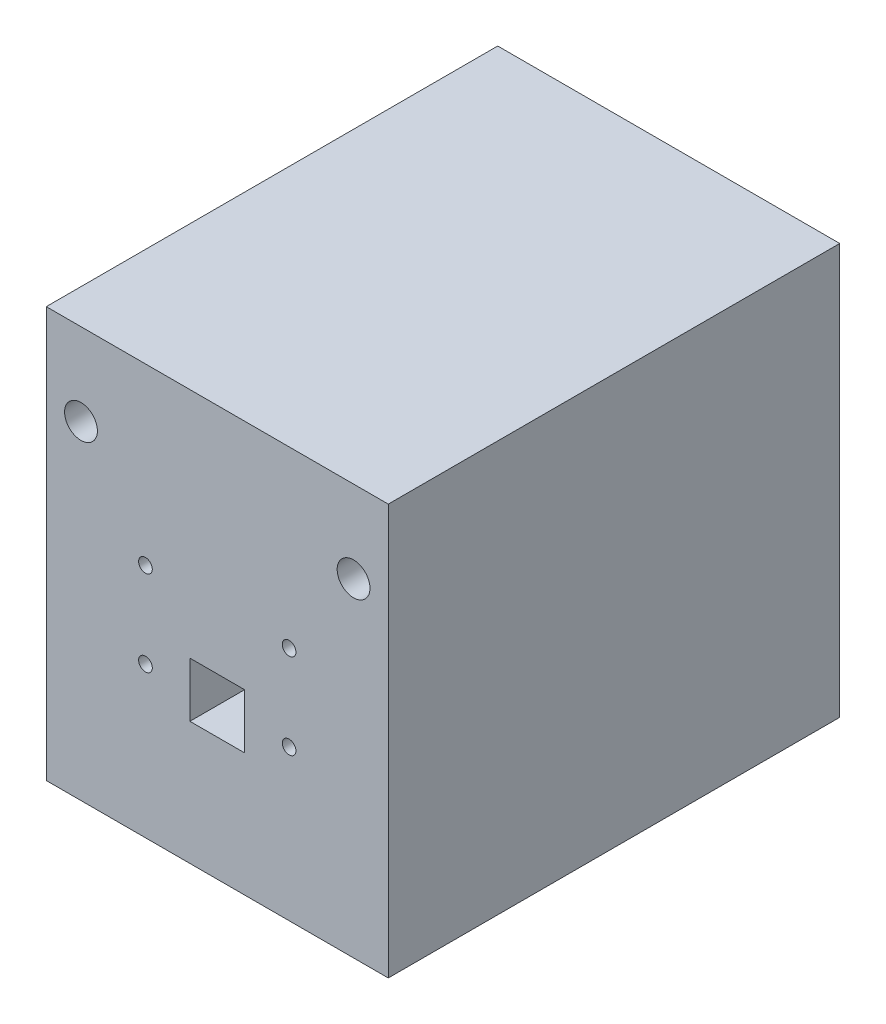
ISO-10303-21;
HEADER;
FILE_DESCRIPTION(('STEP AP214'),'2;1');
FILE_NAME('part.step','',(''),(''),'','','');
FILE_SCHEMA(('AUTOMOTIVE_DESIGN { 1 0 10303 214 1 1 1 1 }'));
ENDSEC;
DATA;
#1=APPLICATION_CONTEXT('core data for automotive mechanical design processes');
#2=APPLICATION_PROTOCOL_DEFINITION('international standard','automotive_design',2000,#1);
#3=PRODUCT_CONTEXT('',#1,'mechanical');
#4=PRODUCT('Part','Part','',(#3));
#5=PRODUCT_RELATED_PRODUCT_CATEGORY('part','',(#4));
#6=PRODUCT_DEFINITION_FORMATION('','',#4);
#7=PRODUCT_DEFINITION_CONTEXT('part definition',#1,'design');
#8=PRODUCT_DEFINITION('design','',#6,#7);
#9=PRODUCT_DEFINITION_SHAPE('','',#8);
#10=(LENGTH_UNIT() NAMED_UNIT(*) SI_UNIT(.MILLI.,.METRE.));
#11=(NAMED_UNIT(*) PLANE_ANGLE_UNIT() SI_UNIT($,.RADIAN.));
#12=(NAMED_UNIT(*) SI_UNIT($,.STERADIAN.) SOLID_ANGLE_UNIT());
#13=UNCERTAINTY_MEASURE_WITH_UNIT(LENGTH_MEASURE(1.E-05),#10,'distance_accuracy_value','');
#14=(GEOMETRIC_REPRESENTATION_CONTEXT(3) GLOBAL_UNCERTAINTY_ASSIGNED_CONTEXT((#13)) GLOBAL_UNIT_ASSIGNED_CONTEXT((#10,
#11,#12)) REPRESENTATION_CONTEXT('',''));
#15=CARTESIAN_POINT('',(0.,0.,0.));
#16=DIRECTION('',(0.,0.,1.));
#17=DIRECTION('',(1.,0.,0.));
#18=AXIS2_PLACEMENT_3D('',#15,#16,#17);
#19=CARTESIAN_POINT('',(0.,0.,66.));
#20=DIRECTION('',(0.,0.,1.));
#21=DIRECTION('',(1.,0.,0.));
#22=AXIS2_PLACEMENT_3D('',#19,#20,#21);
#23=PLANE('',#22);
#24=CARTESIAN_POINT('',(-31.7991969762701,48.,66.));
#25=DIRECTION('',(0.,0.,1.));
#26=DIRECTION('',(1.,0.,0.));
#27=AXIS2_PLACEMENT_3D('',#24,#25,#26);
#28=CIRCLE('',#27,2.4);
#29=CARTESIAN_POINT('',(-29.3991969762702,48.,66.));
#30=VERTEX_POINT('',#29);
#31=EDGE_CURVE('E131',#30,#30,#28,.T.);
#32=ORIENTED_EDGE('',*,*,#31,.F.);
#33=EDGE_LOOP('',(#32));
#34=FACE_BOUND('',#33,.T.);
#35=CARTESIAN_POINT('',(-1.37419697627015,22.,66.));
#36=DIRECTION('',(0.,0.,1.));
#37=DIRECTION('',(1.,0.,0.));
#38=AXIS2_PLACEMENT_3D('',#35,#36,#37);
#39=CIRCLE('',#38,1.);
#40=CARTESIAN_POINT('',(-0.374196976270143,22.,66.));
#41=VERTEX_POINT('',#40);
#42=EDGE_CURVE('E147',#41,#41,#39,.T.);
#43=ORIENTED_EDGE('',*,*,#42,.F.);
#44=EDGE_LOOP('',(#43));
#45=FACE_BOUND('',#44,.T.);
#46=CARTESIAN_POINT('',(-22.3741969762701,34.5,66.));
#47=DIRECTION('',(0.,0.,1.));
#48=DIRECTION('',(1.,0.,0.));
#49=AXIS2_PLACEMENT_3D('',#46,#47,#48);
#50=CIRCLE('',#49,1.);
#51=CARTESIAN_POINT('',(-21.3741969762701,34.5,66.));
#52=VERTEX_POINT('',#51);
#53=EDGE_CURVE('E159',#52,#52,#50,.T.);
#54=ORIENTED_EDGE('',*,*,#53,.F.);
#55=EDGE_LOOP('',(#54));
#56=FACE_BOUND('',#55,.T.);
#57=DIRECTION('',(0.,-1.,0.));
#58=VECTOR('',#57,1.);
#59=CARTESIAN_POINT('',(-36.8741969762702,60.,66.));
#60=LINE('',#59,#58);
#61=CARTESIAN_POINT('',(-36.8741969762702,60.,66.));
#62=VERTEX_POINT('',#61);
#63=CARTESIAN_POINT('',(-36.8741969762701,0.,66.));
#64=VERTEX_POINT('',#63);
#65=EDGE_CURVE('E165',#62,#64,#60,.T.);
#66=ORIENTED_EDGE('',*,*,#65,.T.);
#67=DIRECTION('',(1.,0.,0.));
#68=VECTOR('',#67,1.);
#69=CARTESIAN_POINT('',(-36.8741969762701,0.,66.));
#70=LINE('',#69,#68);
#71=CARTESIAN_POINT('',(13.1258030237298,0.,66.));
#72=VERTEX_POINT('',#71);
#73=EDGE_CURVE('E168',#64,#72,#70,.T.);
#74=ORIENTED_EDGE('',*,*,#73,.T.);
#75=DIRECTION('',(0.,1.,0.));
#76=VECTOR('',#75,1.);
#77=CARTESIAN_POINT('',(13.1258030237298,60.,66.));
#78=LINE('',#77,#76);
#79=CARTESIAN_POINT('',(13.1258030237298,60.,66.));
#80=VERTEX_POINT('',#79);
#81=EDGE_CURVE('E171',#72,#80,#78,.T.);
#82=ORIENTED_EDGE('',*,*,#81,.T.);
#83=DIRECTION('',(-1.,0.,0.));
#84=VECTOR('',#83,1.);
#85=CARTESIAN_POINT('',(-36.8741969762702,60.,66.));
#86=LINE('',#85,#84);
#87=EDGE_CURVE('E173',#80,#62,#86,.T.);
#88=ORIENTED_EDGE('',*,*,#87,.T.);
#89=EDGE_LOOP('',(#66,#74,#82,#88));
#90=FACE_BOUND('',#89,.T.);
#91=CARTESIAN_POINT('',(-22.3741969762701,22.,66.));
#92=DIRECTION('',(0.,0.,1.));
#93=DIRECTION('',(1.,0.,0.));
#94=AXIS2_PLACEMENT_3D('',#91,#92,#93);
#95=CIRCLE('',#94,1.);
#96=CARTESIAN_POINT('',(-21.3741969762701,22.,66.));
#97=VERTEX_POINT('',#96);
#98=EDGE_CURVE('E153',#97,#97,#95,.T.);
#99=ORIENTED_EDGE('',*,*,#98,.F.);
#100=EDGE_LOOP('',(#99));
#101=FACE_BOUND('',#100,.T.);
#102=CARTESIAN_POINT('',(-1.37419697627015,34.5,66.));
#103=DIRECTION('',(0.,0.,1.));
#104=DIRECTION('',(1.,0.,0.));
#105=AXIS2_PLACEMENT_3D('',#102,#103,#104);
#106=CIRCLE('',#105,1.);
#107=CARTESIAN_POINT('',(-0.374196976270143,34.5,66.));
#108=VERTEX_POINT('',#107);
#109=EDGE_CURVE('E141',#108,#108,#106,.T.);
#110=ORIENTED_EDGE('',*,*,#109,.F.);
#111=EDGE_LOOP('',(#110));
#112=FACE_BOUND('',#111,.T.);
#113=DIRECTION('',(1.,0.,0.));
#114=VECTOR('',#113,1.);
#115=CARTESIAN_POINT('',(-15.8741969762701,18.,66.));
#116=LINE('',#115,#114);
#117=CARTESIAN_POINT('',(-15.8741969762701,18.,66.));
#118=VERTEX_POINT('',#117);
#119=CARTESIAN_POINT('',(-7.87419697627014,18.,66.));
#120=VERTEX_POINT('',#119);
#121=EDGE_CURVE('E110',#118,#120,#116,.T.);
#122=ORIENTED_EDGE('',*,*,#121,.F.);
#123=DIRECTION('',(0.,-1.,0.));
#124=VECTOR('',#123,1.);
#125=CARTESIAN_POINT('',(-15.8741969762701,26.,66.));
#126=LINE('',#125,#124);
#127=CARTESIAN_POINT('',(-15.8741969762701,26.,66.));
#128=VERTEX_POINT('',#127);
#129=EDGE_CURVE('E102',#128,#118,#126,.T.);
#130=ORIENTED_EDGE('',*,*,#129,.F.);
#131=DIRECTION('',(-1.,0.,0.));
#132=VECTOR('',#131,1.);
#133=CARTESIAN_POINT('',(-15.8741969762701,26.,66.));
#134=LINE('',#133,#132);
#135=CARTESIAN_POINT('',(-7.87419697627014,26.,66.));
#136=VERTEX_POINT('',#135);
#137=EDGE_CURVE('E125',#136,#128,#134,.T.);
#138=ORIENTED_EDGE('',*,*,#137,.F.);
#139=DIRECTION('',(0.,1.,0.));
#140=VECTOR('',#139,1.);
#141=CARTESIAN_POINT('',(-7.87419697627014,26.,66.));
#142=LINE('',#141,#140);
#143=EDGE_CURVE('E123',#120,#136,#142,.T.);
#144=ORIENTED_EDGE('',*,*,#143,.F.);
#145=EDGE_LOOP('',(#122,#130,#138,#144));
#146=FACE_BOUND('',#145,.T.);
#147=CARTESIAN_POINT('',(8.05080302372985,48.,66.));
#148=DIRECTION('',(0.,0.,1.));
#149=DIRECTION('',(1.,0.,0.));
#150=AXIS2_PLACEMENT_3D('',#147,#148,#149);
#151=CIRCLE('',#150,2.4);
#152=CARTESIAN_POINT('',(10.4508030237299,48.,66.));
#153=VERTEX_POINT('',#152);
#154=EDGE_CURVE('E280',#153,#153,#151,.T.);
#155=ORIENTED_EDGE('',*,*,#154,.F.);
#156=EDGE_LOOP('',(#155));
#157=FACE_BOUND('',#156,.T.);
#158=ADVANCED_FACE('F37',(#34,#45,#56,#90,#101,#112,#146,#157),#23,.T.);
#159=CARTESIAN_POINT('',(0.,0.,0.));
#160=DIRECTION('',(0.,0.,1.));
#161=DIRECTION('',(1.,0.,0.));
#162=AXIS2_PLACEMENT_3D('',#159,#160,#161);
#163=PLANE('',#162);
#164=CARTESIAN_POINT('',(-1.37419697627015,34.5,0.));
#165=DIRECTION('',(0.,0.,1.));
#166=DIRECTION('',(1.,0.,0.));
#167=AXIS2_PLACEMENT_3D('',#164,#165,#166);
#168=CIRCLE('',#167,1.);
#169=CARTESIAN_POINT('',(-0.374196976270143,34.5,0.));
#170=VERTEX_POINT('',#169);
#171=EDGE_CURVE('E118',#170,#170,#168,.T.);
#172=ORIENTED_EDGE('',*,*,#171,.T.);
#173=EDGE_LOOP('',(#172));
#174=FACE_BOUND('',#173,.T.);
#175=CARTESIAN_POINT('',(-1.37419697627015,22.,0.));
#176=DIRECTION('',(0.,0.,1.));
#177=DIRECTION('',(1.,0.,0.));
#178=AXIS2_PLACEMENT_3D('',#175,#176,#177);
#179=CIRCLE('',#178,1.);
#180=CARTESIAN_POINT('',(-0.374196976270143,22.,0.));
#181=VERTEX_POINT('',#180);
#182=EDGE_CURVE('E144',#181,#181,#179,.T.);
#183=ORIENTED_EDGE('',*,*,#182,.T.);
#184=EDGE_LOOP('',(#183));
#185=FACE_BOUND('',#184,.T.);
#186=CARTESIAN_POINT('',(-22.3741969762701,22.,0.));
#187=DIRECTION('',(0.,0.,1.));
#188=DIRECTION('',(1.,0.,0.));
#189=AXIS2_PLACEMENT_3D('',#186,#187,#188);
#190=CIRCLE('',#189,1.);
#191=CARTESIAN_POINT('',(-21.3741969762701,22.,0.));
#192=VERTEX_POINT('',#191);
#193=EDGE_CURVE('E150',#192,#192,#190,.T.);
#194=ORIENTED_EDGE('',*,*,#193,.T.);
#195=EDGE_LOOP('',(#194));
#196=FACE_BOUND('',#195,.T.);
#197=CARTESIAN_POINT('',(-22.3741969762701,34.5,0.));
#198=DIRECTION('',(0.,0.,1.));
#199=DIRECTION('',(1.,0.,0.));
#200=AXIS2_PLACEMENT_3D('',#197,#198,#199);
#201=CIRCLE('',#200,1.);
#202=CARTESIAN_POINT('',(-21.3741969762701,34.5,0.));
#203=VERTEX_POINT('',#202);
#204=EDGE_CURVE('E156',#203,#203,#201,.T.);
#205=ORIENTED_EDGE('',*,*,#204,.T.);
#206=EDGE_LOOP('',(#205));
#207=FACE_BOUND('',#206,.T.);
#208=DIRECTION('',(0.,-1.,0.));
#209=VECTOR('',#208,1.);
#210=CARTESIAN_POINT('',(-36.8741969762702,60.,0.));
#211=LINE('',#210,#209);
#212=CARTESIAN_POINT('',(-36.8741969762702,60.,0.));
#213=VERTEX_POINT('',#212);
#214=CARTESIAN_POINT('',(-36.8741969762701,0.,0.));
#215=VERTEX_POINT('',#214);
#216=EDGE_CURVE('E162',#213,#215,#211,.T.);
#217=ORIENTED_EDGE('',*,*,#216,.F.);
#218=DIRECTION('',(-1.,0.,0.));
#219=VECTOR('',#218,1.);
#220=CARTESIAN_POINT('',(-36.8741969762702,60.,0.));
#221=LINE('',#220,#219);
#222=CARTESIAN_POINT('',(13.1258030237298,60.,0.));
#223=VERTEX_POINT('',#222);
#224=EDGE_CURVE('E169',#223,#213,#221,.T.);
#225=ORIENTED_EDGE('',*,*,#224,.F.);
#226=DIRECTION('',(0.,1.,0.));
#227=VECTOR('',#226,1.);
#228=CARTESIAN_POINT('',(13.1258030237298,60.,0.));
#229=LINE('',#228,#227);
#230=CARTESIAN_POINT('',(13.1258030237298,0.,0.));
#231=VERTEX_POINT('',#230);
#232=EDGE_CURVE('E180',#231,#223,#229,.T.);
#233=ORIENTED_EDGE('',*,*,#232,.F.);
#234=DIRECTION('',(1.,0.,0.));
#235=VECTOR('',#234,1.);
#236=CARTESIAN_POINT('',(-36.8741969762701,0.,0.));
#237=LINE('',#236,#235);
#238=EDGE_CURVE('E178',#215,#231,#237,.T.);
#239=ORIENTED_EDGE('',*,*,#238,.F.);
#240=EDGE_LOOP('',(#217,#225,#233,#239));
#241=FACE_BOUND('',#240,.T.);
#242=DIRECTION('',(0.,-1.,0.));
#243=VECTOR('',#242,1.);
#244=CARTESIAN_POINT('',(-15.8741969762701,26.,0.));
#245=LINE('',#244,#243);
#246=CARTESIAN_POINT('',(-15.8741969762701,26.,0.));
#247=VERTEX_POINT('',#246);
#248=CARTESIAN_POINT('',(-15.8741969762701,18.,0.));
#249=VERTEX_POINT('',#248);
#250=EDGE_CURVE('E60',#247,#249,#245,.T.);
#251=ORIENTED_EDGE('',*,*,#250,.T.);
#252=DIRECTION('',(1.,0.,0.));
#253=VECTOR('',#252,1.);
#254=CARTESIAN_POINT('',(-15.8741969762701,18.,0.));
#255=LINE('',#254,#253);
#256=CARTESIAN_POINT('',(-7.87419697627014,18.,0.));
#257=VERTEX_POINT('',#256);
#258=EDGE_CURVE('E117',#249,#257,#255,.T.);
#259=ORIENTED_EDGE('',*,*,#258,.T.);
#260=DIRECTION('',(0.,1.,0.));
#261=VECTOR('',#260,1.);
#262=CARTESIAN_POINT('',(-7.87419697627014,26.,0.));
#263=LINE('',#262,#261);
#264=CARTESIAN_POINT('',(-7.87419697627014,26.,0.));
#265=VERTEX_POINT('',#264);
#266=EDGE_CURVE('E133',#257,#265,#263,.T.);
#267=ORIENTED_EDGE('',*,*,#266,.T.);
#268=DIRECTION('',(-1.,0.,0.));
#269=VECTOR('',#268,1.);
#270=CARTESIAN_POINT('',(-15.8741969762701,26.,0.));
#271=LINE('',#270,#269);
#272=EDGE_CURVE('E111',#265,#247,#271,.T.);
#273=ORIENTED_EDGE('',*,*,#272,.T.);
#274=EDGE_LOOP('',(#251,#259,#267,#273));
#275=FACE_BOUND('',#274,.T.);
#276=CARTESIAN_POINT('',(-31.7991969762701,48.,0.));
#277=DIRECTION('',(0.,0.,1.));
#278=DIRECTION('',(1.,0.,0.));
#279=AXIS2_PLACEMENT_3D('',#276,#277,#278);
#280=CIRCLE('',#279,2.4);
#281=CARTESIAN_POINT('',(-29.3991969762702,48.,0.));
#282=VERTEX_POINT('',#281);
#283=EDGE_CURVE('E286',#282,#282,#280,.T.);
#284=ORIENTED_EDGE('',*,*,#283,.T.);
#285=EDGE_LOOP('',(#284));
#286=FACE_BOUND('',#285,.T.);
#287=CARTESIAN_POINT('',(8.05080302372985,48.,0.));
#288=DIRECTION('',(0.,0.,1.));
#289=DIRECTION('',(1.,0.,0.));
#290=AXIS2_PLACEMENT_3D('',#287,#288,#289);
#291=CIRCLE('',#290,2.4);
#292=CARTESIAN_POINT('',(10.4508030237299,48.,0.));
#293=VERTEX_POINT('',#292);
#294=EDGE_CURVE('E283',#293,#293,#291,.T.);
#295=ORIENTED_EDGE('',*,*,#294,.T.);
#296=EDGE_LOOP('',(#295));
#297=FACE_BOUND('',#296,.T.);
#298=ADVANCED_FACE('F198',(#174,#185,#196,#207,#241,#275,#286,#297),#163,.F.);
#299=CARTESIAN_POINT('',(-36.8741969762702,60.,66.));
#300=DIRECTION('',(1.,0.,0.));
#301=DIRECTION('',(0.,1.,0.));
#302=AXIS2_PLACEMENT_3D('',#299,#300,#301);
#303=PLANE('',#302);
#304=ORIENTED_EDGE('',*,*,#216,.T.);
#305=DIRECTION('',(0.,0.,-1.));
#306=VECTOR('',#305,1.);
#307=CARTESIAN_POINT('',(-36.8741969762701,0.,66.));
#308=LINE('',#307,#306);
#309=EDGE_CURVE('E11',#64,#215,#308,.T.);
#310=ORIENTED_EDGE('',*,*,#309,.F.);
#311=ORIENTED_EDGE('',*,*,#65,.F.);
#312=DIRECTION('',(0.,0.,-1.));
#313=VECTOR('',#312,1.);
#314=CARTESIAN_POINT('',(-36.8741969762702,60.,66.));
#315=LINE('',#314,#313);
#316=EDGE_CURVE('E175',#62,#213,#315,.T.);
#317=ORIENTED_EDGE('',*,*,#316,.T.);
#318=EDGE_LOOP('',(#304,#310,#311,#317));
#319=FACE_BOUND('',#318,.T.);
#320=ADVANCED_FACE('F39',(#319),#303,.F.);
#321=CARTESIAN_POINT('',(-36.8741969762701,0.,66.));
#322=DIRECTION('',(0.,1.,0.));
#323=DIRECTION('',(0.,0.,1.));
#324=AXIS2_PLACEMENT_3D('',#321,#322,#323);
#325=PLANE('',#324);
#326=ORIENTED_EDGE('',*,*,#238,.T.);
#327=DIRECTION('',(0.,0.,-1.));
#328=VECTOR('',#327,1.);
#329=CARTESIAN_POINT('',(13.1258030237298,0.,66.));
#330=LINE('',#329,#328);
#331=EDGE_CURVE('E45',#72,#231,#330,.T.);
#332=ORIENTED_EDGE('',*,*,#331,.F.);
#333=ORIENTED_EDGE('',*,*,#73,.F.);
#334=ORIENTED_EDGE('',*,*,#309,.T.);
#335=EDGE_LOOP('',(#326,#332,#333,#334));
#336=FACE_BOUND('',#335,.T.);
#337=ADVANCED_FACE('F209',(#336),#325,.F.);
#338=CARTESIAN_POINT('',(13.1258030237298,60.,66.));
#339=DIRECTION('',(-1.,0.,0.));
#340=DIRECTION('',(0.,-1.,0.));
#341=AXIS2_PLACEMENT_3D('',#338,#339,#340);
#342=PLANE('',#341);
#343=ORIENTED_EDGE('',*,*,#232,.T.);
#344=DIRECTION('',(0.,0.,-1.));
#345=VECTOR('',#344,1.);
#346=CARTESIAN_POINT('',(13.1258030237298,60.,66.));
#347=LINE('',#346,#345);
#348=EDGE_CURVE('E185',#80,#223,#347,.T.);
#349=ORIENTED_EDGE('',*,*,#348,.F.);
#350=ORIENTED_EDGE('',*,*,#81,.F.);
#351=ORIENTED_EDGE('',*,*,#331,.T.);
#352=EDGE_LOOP('',(#343,#349,#350,#351));
#353=FACE_BOUND('',#352,.T.);
#354=ADVANCED_FACE('F192',(#353),#342,.F.);
#355=CARTESIAN_POINT('',(-36.8741969762702,60.,66.));
#356=DIRECTION('',(0.,-1.,0.));
#357=DIRECTION('',(0.,0.,-1.));
#358=AXIS2_PLACEMENT_3D('',#355,#356,#357);
#359=PLANE('',#358);
#360=ORIENTED_EDGE('',*,*,#224,.T.);
#361=ORIENTED_EDGE('',*,*,#316,.F.);
#362=ORIENTED_EDGE('',*,*,#87,.F.);
#363=ORIENTED_EDGE('',*,*,#348,.T.);
#364=EDGE_LOOP('',(#360,#361,#362,#363));
#365=FACE_BOUND('',#364,.T.);
#366=ADVANCED_FACE('F202',(#365),#359,.F.);
#367=CARTESIAN_POINT('',(-22.3741969762701,34.5,66.));
#368=DIRECTION('',(0.,0.,-1.));
#369=DIRECTION('',(-1.,0.,0.));
#370=AXIS2_PLACEMENT_3D('',#367,#368,#369);
#371=CYLINDRICAL_SURFACE('',#370,1.);
#372=ORIENTED_EDGE('',*,*,#53,.T.);
#373=EDGE_LOOP('',(#372));
#374=FACE_BOUND('',#373,.T.);
#375=ORIENTED_EDGE('',*,*,#204,.F.);
#376=EDGE_LOOP('',(#375));
#377=FACE_BOUND('',#376,.T.);
#378=ADVANCED_FACE('F227',(#374,#377),#371,.F.);
#379=CARTESIAN_POINT('',(-22.3741969762701,22.,66.));
#380=DIRECTION('',(0.,0.,-1.));
#381=DIRECTION('',(-1.,0.,0.));
#382=AXIS2_PLACEMENT_3D('',#379,#380,#381);
#383=CYLINDRICAL_SURFACE('',#382,1.);
#384=ORIENTED_EDGE('',*,*,#98,.T.);
#385=EDGE_LOOP('',(#384));
#386=FACE_BOUND('',#385,.T.);
#387=ORIENTED_EDGE('',*,*,#193,.F.);
#388=EDGE_LOOP('',(#387));
#389=FACE_BOUND('',#388,.T.);
#390=ADVANCED_FACE('F234',(#386,#389),#383,.F.);
#391=CARTESIAN_POINT('',(-1.37419697627015,22.,66.));
#392=DIRECTION('',(0.,0.,-1.));
#393=DIRECTION('',(-1.,0.,0.));
#394=AXIS2_PLACEMENT_3D('',#391,#392,#393);
#395=CYLINDRICAL_SURFACE('',#394,1.);
#396=ORIENTED_EDGE('',*,*,#42,.T.);
#397=EDGE_LOOP('',(#396));
#398=FACE_BOUND('',#397,.T.);
#399=ORIENTED_EDGE('',*,*,#182,.F.);
#400=EDGE_LOOP('',(#399));
#401=FACE_BOUND('',#400,.T.);
#402=ADVANCED_FACE('F239',(#398,#401),#395,.F.);
#403=CARTESIAN_POINT('',(-1.37419697627015,34.5,66.));
#404=DIRECTION('',(0.,0.,-1.));
#405=DIRECTION('',(-1.,0.,0.));
#406=AXIS2_PLACEMENT_3D('',#403,#404,#405);
#407=CYLINDRICAL_SURFACE('',#406,1.);
#408=ORIENTED_EDGE('',*,*,#109,.T.);
#409=EDGE_LOOP('',(#408));
#410=FACE_BOUND('',#409,.T.);
#411=ORIENTED_EDGE('',*,*,#171,.F.);
#412=EDGE_LOOP('',(#411));
#413=FACE_BOUND('',#412,.T.);
#414=ADVANCED_FACE('F249',(#410,#413),#407,.F.);
#415=CARTESIAN_POINT('',(-15.8741969762701,26.,66.));
#416=DIRECTION('',(1.,0.,0.));
#417=DIRECTION('',(0.,0.,-1.));
#418=AXIS2_PLACEMENT_3D('',#415,#416,#417);
#419=PLANE('',#418);
#420=ORIENTED_EDGE('',*,*,#250,.F.);
#421=DIRECTION('',(0.,0.,-1.));
#422=VECTOR('',#421,1.);
#423=CARTESIAN_POINT('',(-15.8741969762701,26.,66.));
#424=LINE('',#423,#422);
#425=EDGE_CURVE('E106',#128,#247,#424,.T.);
#426=ORIENTED_EDGE('',*,*,#425,.F.);
#427=ORIENTED_EDGE('',*,*,#129,.T.);
#428=DIRECTION('',(0.,0.,-1.));
#429=VECTOR('',#428,1.);
#430=CARTESIAN_POINT('',(-15.8741969762701,18.,66.));
#431=LINE('',#430,#429);
#432=EDGE_CURVE('E105',#118,#249,#431,.T.);
#433=ORIENTED_EDGE('',*,*,#432,.T.);
#434=EDGE_LOOP('',(#420,#426,#427,#433));
#435=FACE_BOUND('',#434,.T.);
#436=ADVANCED_FACE('F104',(#435),#419,.T.);
#437=CARTESIAN_POINT('',(-15.8741969762701,18.,66.));
#438=DIRECTION('',(0.,1.,0.));
#439=DIRECTION('',(-1.,0.,0.));
#440=AXIS2_PLACEMENT_3D('',#437,#438,#439);
#441=PLANE('',#440);
#442=ORIENTED_EDGE('',*,*,#258,.F.);
#443=ORIENTED_EDGE('',*,*,#432,.F.);
#444=ORIENTED_EDGE('',*,*,#121,.T.);
#445=DIRECTION('',(0.,0.,-1.));
#446=VECTOR('',#445,1.);
#447=CARTESIAN_POINT('',(-7.87419697627014,18.,66.));
#448=LINE('',#447,#446);
#449=EDGE_CURVE('E119',#120,#257,#448,.T.);
#450=ORIENTED_EDGE('',*,*,#449,.T.);
#451=EDGE_LOOP('',(#442,#443,#444,#450));
#452=FACE_BOUND('',#451,.T.);
#453=ADVANCED_FACE('F114',(#452),#441,.T.);
#454=CARTESIAN_POINT('',(-7.87419697627014,26.,66.));
#455=DIRECTION('',(-1.,0.,0.));
#456=DIRECTION('',(0.,0.,1.));
#457=AXIS2_PLACEMENT_3D('',#454,#455,#456);
#458=PLANE('',#457);
#459=ORIENTED_EDGE('',*,*,#266,.F.);
#460=ORIENTED_EDGE('',*,*,#449,.F.);
#461=ORIENTED_EDGE('',*,*,#143,.T.);
#462=DIRECTION('',(0.,0.,-1.));
#463=VECTOR('',#462,1.);
#464=CARTESIAN_POINT('',(-7.87419697627014,26.,66.));
#465=LINE('',#464,#463);
#466=EDGE_CURVE('E52',#136,#265,#465,.T.);
#467=ORIENTED_EDGE('',*,*,#466,.T.);
#468=EDGE_LOOP('',(#459,#460,#461,#467));
#469=FACE_BOUND('',#468,.T.);
#470=ADVANCED_FACE('F261',(#469),#458,.T.);
#471=CARTESIAN_POINT('',(-15.8741969762701,26.,66.));
#472=DIRECTION('',(0.,-1.,0.));
#473=DIRECTION('',(1.,0.,0.));
#474=AXIS2_PLACEMENT_3D('',#471,#472,#473);
#475=PLANE('',#474);
#476=ORIENTED_EDGE('',*,*,#272,.F.);
#477=ORIENTED_EDGE('',*,*,#466,.F.);
#478=ORIENTED_EDGE('',*,*,#137,.T.);
#479=ORIENTED_EDGE('',*,*,#425,.T.);
#480=EDGE_LOOP('',(#476,#477,#478,#479));
#481=FACE_BOUND('',#480,.T.);
#482=ADVANCED_FACE('F264',(#481),#475,.T.);
#483=CARTESIAN_POINT('',(-31.7991969762701,48.,66.));
#484=DIRECTION('',(0.,0.,-1.));
#485=DIRECTION('',(-1.,0.,0.));
#486=AXIS2_PLACEMENT_3D('',#483,#484,#485);
#487=CYLINDRICAL_SURFACE('',#486,2.4);
#488=ORIENTED_EDGE('',*,*,#31,.T.);
#489=EDGE_LOOP('',(#488));
#490=FACE_BOUND('',#489,.T.);
#491=ORIENTED_EDGE('',*,*,#283,.F.);
#492=EDGE_LOOP('',(#491));
#493=FACE_BOUND('',#492,.T.);
#494=ADVANCED_FACE('F268',(#490,#493),#487,.F.);
#495=CARTESIAN_POINT('',(8.05080302372985,48.,66.));
#496=DIRECTION('',(0.,0.,-1.));
#497=DIRECTION('',(-1.,0.,0.));
#498=AXIS2_PLACEMENT_3D('',#495,#496,#497);
#499=CYLINDRICAL_SURFACE('',#498,2.4);
#500=ORIENTED_EDGE('',*,*,#154,.T.);
#501=EDGE_LOOP('',(#500));
#502=FACE_BOUND('',#501,.T.);
#503=ORIENTED_EDGE('',*,*,#294,.F.);
#504=EDGE_LOOP('',(#503));
#505=FACE_BOUND('',#504,.T.);
#506=ADVANCED_FACE('F271',(#502,#505),#499,.F.);
#507=CLOSED_SHELL('',(#158,#298,#320,#337,#354,#366,#378,#390,#402,#414,#436,#453,#470,#482,
#494,#506));
#508=MANIFOLD_SOLID_BREP('B2',#507);
#509=ADVANCED_BREP_SHAPE_REPRESENTATION('',(#18,#508),#14);
#510=SHAPE_DEFINITION_REPRESENTATION(#9,#509);
ENDSEC;
END-ISO-10303-21;
